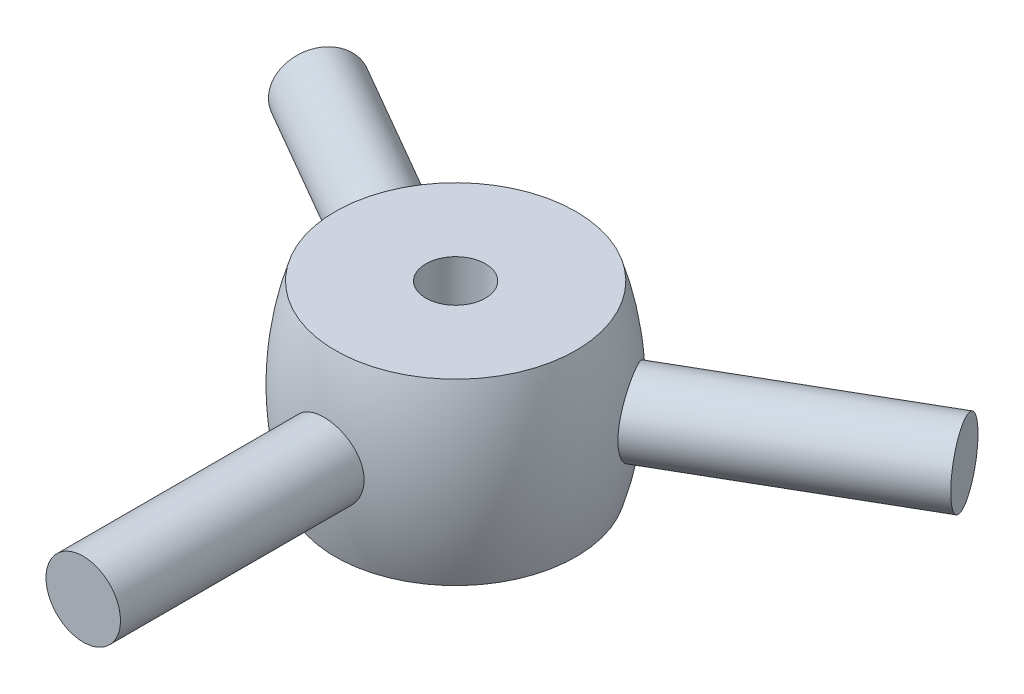
ISO-10303-21;
HEADER;
FILE_DESCRIPTION(('STEP AP214'),'2;1');
FILE_NAME('part.step','',(''),(''),'','','');
FILE_SCHEMA(('AUTOMOTIVE_DESIGN { 1 0 10303 214 1 1 1 1 }'));
ENDSEC;
DATA;
#1=APPLICATION_CONTEXT('core data for automotive mechanical design processes');
#2=APPLICATION_PROTOCOL_DEFINITION('international standard','automotive_design',2000,#1);
#3=PRODUCT_CONTEXT('',#1,'mechanical');
#4=PRODUCT('Part','Part','',(#3));
#5=PRODUCT_RELATED_PRODUCT_CATEGORY('part','',(#4));
#6=PRODUCT_DEFINITION_FORMATION('','',#4);
#7=PRODUCT_DEFINITION_CONTEXT('part definition',#1,'design');
#8=PRODUCT_DEFINITION('design','',#6,#7);
#9=PRODUCT_DEFINITION_SHAPE('','',#8);
#10=(LENGTH_UNIT() NAMED_UNIT(*) SI_UNIT(.MILLI.,.METRE.));
#11=(NAMED_UNIT(*) PLANE_ANGLE_UNIT() SI_UNIT($,.RADIAN.));
#12=(NAMED_UNIT(*) SI_UNIT($,.STERADIAN.) SOLID_ANGLE_UNIT());
#13=UNCERTAINTY_MEASURE_WITH_UNIT(LENGTH_MEASURE(1.E-05),#10,'distance_accuracy_value','');
#14=(GEOMETRIC_REPRESENTATION_CONTEXT(3) GLOBAL_UNCERTAINTY_ASSIGNED_CONTEXT((#13)) GLOBAL_UNIT_ASSIGNED_CONTEXT((#10,
#11,#12)) REPRESENTATION_CONTEXT('',''));
#15=CARTESIAN_POINT('',(0.,0.,0.));
#16=DIRECTION('',(0.,0.,1.));
#17=DIRECTION('',(1.,0.,0.));
#18=AXIS2_PLACEMENT_3D('',#15,#16,#17);
#19=CARTESIAN_POINT('',(0.,0.,0.));
#20=DIRECTION('',(0.,-1.,0.));
#21=DIRECTION('',(0.,0.,-1.));
#22=AXIS2_PLACEMENT_3D('',#19,#20,#21);
#23=DEGENERATE_TOROIDAL_SURFACE('',#22,5.5,10.,.F.);
#24=CARTESIAN_POINT('',(-3.24845380329226,-0.689243322092074,-3.07962393393491));
#25=CARTESIAN_POINT('',(-3.22484438254061,-0.631097070289249,-3.11036677556222));
#26=CARTESIAN_POINT('',(-3.20396061353493,-0.569677224789108,-3.13709665875448));
#27=CARTESIAN_POINT('',(-3.16860573594217,-0.44198786587889,-3.18193798904436));
#28=CARTESIAN_POINT('',(-3.15413993316492,-0.375714392448993,-3.20004230619273));
#29=CARTESIAN_POINT('',(-3.13232272188576,-0.240196785786498,-3.22722233877392));
#30=CARTESIAN_POINT('',(-3.12497188888781,-0.170952412721672,-3.23629732385868));
#31=CARTESIAN_POINT('',(-3.11775209346771,-0.0315001414362864,-3.24521127344618));
#32=CARTESIAN_POINT('',(-3.11788154369118,0.0387075492019343,-3.24505219746389));
#33=CARTESIAN_POINT('',(-3.12558497221378,0.177609367819586,-3.235539586718));
#34=CARTESIAN_POINT('',(-3.13310934250027,0.246310463708132,-3.2262473209237));
#35=CARTESIAN_POINT('',(-3.15516435448313,0.380743401034796,-3.19876074505131));
#36=CARTESIAN_POINT('',(-3.16969538129634,0.446475079043348,-3.18056594564978));
#37=CARTESIAN_POINT('',(-3.20514291509536,0.573358149666035,-3.13558653178809));
#38=CARTESIAN_POINT('',(-3.22608038494492,0.634493672434797,-3.10877370306494));
#39=CARTESIAN_POINT('',(-3.27338884726856,0.750281810713347,-3.04713771342991));
#40=CARTESIAN_POINT('',(-3.2997602223925,0.804933969244193,-3.01231398837907));
#41=CARTESIAN_POINT('',(-3.35714196603362,0.906843637498807,-2.93495712807962));
#42=CARTESIAN_POINT('',(-3.38820061044745,0.954012264357967,-2.89234265375952));
#43=CARTESIAN_POINT('',(-3.45347180379742,1.0388992989763,-2.80060954030891));
#44=CARTESIAN_POINT('',(-3.48768438732015,1.07661760308486,-2.75149082984934));
#45=CARTESIAN_POINT('',(-3.5580069527427,1.14157906135127,-2.64780810781039));
#46=CARTESIAN_POINT('',(-3.59412005554269,1.1688043332913,-2.59323499836818));
#47=CARTESIAN_POINT('',(-3.66687265254488,1.21187272092588,-2.48009480451684));
#48=CARTESIAN_POINT('',(-3.70351210921709,1.22771664406285,-2.42152800376038));
#49=CARTESIAN_POINT('',(-3.77571054430428,1.24743527803801,-2.302597406924));
#50=CARTESIAN_POINT('',(-3.81127669721551,1.25142923625236,-2.24225772839122));
#51=CARTESIAN_POINT('',(-3.88064136698696,1.24766411242021,-2.12093491783673));
#52=CARTESIAN_POINT('',(-3.9144399546915,1.23990550179284,-2.05995181172164));
#53=CARTESIAN_POINT('',(-3.97918824846147,1.21295855889574,-1.93951412803015));
#54=CARTESIAN_POINT('',(-4.01015419170858,1.1938407887394,-1.88005245816648));
#55=CARTESIAN_POINT('',(-4.06881572242904,1.14480038563866,-1.76404404847545));
#56=CARTESIAN_POINT('',(-4.09651115928154,1.11487725531836,-1.70749744296684));
#57=CARTESIAN_POINT('',(-4.14836437924273,1.04483010672676,-1.59864819992667));
#58=CARTESIAN_POINT('',(-4.17249541187546,1.00463458151197,-1.54637884945278));
#59=CARTESIAN_POINT('',(-4.21670096481432,0.915271210789765,-1.4481760552166));
#60=CARTESIAN_POINT('',(-4.23677521461299,0.866102767381299,-1.40224303402735));
#61=CARTESIAN_POINT('',(-4.27289423714879,0.759622658544626,-1.31779243360148));
#62=CARTESIAN_POINT('',(-4.2888983499025,0.702237142587121,-1.27935051441136));
#63=CARTESIAN_POINT('',(-4.31656299025421,0.581277268829629,-1.21176084753875));
#64=CARTESIAN_POINT('',(-4.32822360650662,0.517703037379932,-1.18261291016003));
#65=CARTESIAN_POINT('',(-4.34716566529554,0.386336396174407,-1.13472857359162));
#66=CARTESIAN_POINT('',(-4.35445926838257,0.318556285437204,-1.11596327369829));
#67=CARTESIAN_POINT('',(-4.36472523142693,0.180561892828413,-1.08942546313328));
#68=CARTESIAN_POINT('',(-4.36769793556495,0.110347805291171,-1.08165207690336));
#69=CARTESIAN_POINT('',(-4.36932008286944,-0.0296850615935567,-1.07741914020982));
#70=CARTESIAN_POINT('',(-4.36801728306748,-0.0994995407915165,-1.08083461036708));
#71=CARTESIAN_POINT('',(-4.36119050959416,-0.237515472930417,-1.09857474901346));
#72=CARTESIAN_POINT('',(-4.35566657506817,-0.305716940823833,-1.11289931633531));
#73=CARTESIAN_POINT('',(-4.34040452444434,-0.438450365676257,-1.15188537578522));
#74=CARTESIAN_POINT('',(-4.33067473622807,-0.502989290506272,-1.17652643752318));
#75=CARTESIAN_POINT('',(-4.30700176587148,-0.626773666431315,-1.23526575882348));
#76=CARTESIAN_POINT('',(-4.29305830687772,-0.686018769371539,-1.26936463978674));
#77=CARTESIAN_POINT('',(-4.26082396898249,-0.798190441094293,-1.34625695915239));
#78=CARTESIAN_POINT('',(-4.24248989579847,-0.851045838348998,-1.38913612749267));
#79=CARTESIAN_POINT('',(-4.20165501179393,-0.948275340661744,-1.48194973514138));
#80=CARTESIAN_POINT('',(-4.17915400819929,-0.992649053139696,-1.53188450083661));
#81=CARTESIAN_POINT('',(-4.13004401388521,-1.07193804956651,-1.63755922359385));
#82=CARTESIAN_POINT('',(-4.10340918881673,-1.10678976032526,-1.69333491694396));
#83=CARTESIAN_POINT('',(-4.04653346846624,-1.16563132085526,-1.80865120686594));
#84=CARTESIAN_POINT('',(-4.01629275347636,-1.18962171339787,-1.86819161513466));
#85=CARTESIAN_POINT('',(-3.95303438635995,-1.22588659846702,-1.98875116518105));
#86=CARTESIAN_POINT('',(-3.92003811505983,-1.23824356144826,-2.04975670486424));
#87=CARTESIAN_POINT('',(-3.85189622283417,-1.25115567359173,-2.17181201984632));
#88=CARTESIAN_POINT('',(-3.8167508026085,-1.25171192308953,-2.23286179049013));
#89=CARTESIAN_POINT('',(-3.74566734557912,-1.24106049724961,-2.35265322518054));
#90=CARTESIAN_POINT('',(-3.70974017092101,-1.22996581663033,-2.41141143155223));
#91=CARTESIAN_POINT('',(-3.63790139436128,-1.19651921347012,-2.52565705595127));
#92=CARTESIAN_POINT('',(-3.60198979709181,-1.17416500976333,-2.58114380864039));
#93=CARTESIAN_POINT('',(-3.53131763704644,-1.11877507294659,-2.68759243887384));
#94=CARTESIAN_POINT('',(-3.49656095155657,-1.08570671866239,-2.73853988383647));
#95=CARTESIAN_POINT('',(-3.42961171363547,-1.00986379471403,-2.83448988734019));
#96=CARTESIAN_POINT('',(-3.39741706842253,-0.967097259188263,-2.87949731814036));
#97=CARTESIAN_POINT('',(-3.34502986026555,-0.885788988805144,-2.95135209256183));
#98=CARTESIAN_POINT('',(-3.32394519003071,-0.849229369299132,-2.97981994499963));
#99=CARTESIAN_POINT('',(-3.28424417373358,-0.772105039698048,-3.03277435234734));
#100=CARTESIAN_POINT('',(-3.26562785567472,-0.731540284173868,-3.05726086208968));
#101=CARTESIAN_POINT('',(-3.24845380329226,-0.689243322092074,-3.07962393393491));
#102=B_SPLINE_CURVE_WITH_KNOTS('',3,(#24,#25,#26,#27,#28,#29,#30,#31,#32,#33,#34,#35,#36,#37,
#38,#39,#40,#41,#42,#43,#44,#45,#46,#47,#48,#49,#50,#51,#52,#53,#54,#55,#56,#57,#58,#59,#60,#61,
#62,#63,#64,#65,#66,#67,#68,#69,#70,#71,#72,#73,#74,#75,#76,#77,#78,#79,#80,#81,#82,#83,#84,#85,
#86,#87,#88,#89,#90,#91,#92,#93,#94,#95,#96,#97,#98,#99,#100,#101),.UNSPECIFIED.,.T.,.F.,(4,2,2,
2,2,2,2,2,2,2,2,2,2,2,2,2,2,2,2,2,2,2,2,2,2,2,2,2,2,2,2,2,2,2,2,2,2,2,4),(0.,0.209465061458476,
0.419102968986675,0.628757831943502,0.838368205228804,1.04658196218851,1.25480716480222,
1.46372113355804,1.672649818845,1.88389927677195,2.09515105156978,2.30676126617535,
2.51835646674836,2.7278150176948,2.93726516706088,3.14542763643549,3.35359968884958,
3.56326230882089,3.77293890454672,3.98463442454076,4.1963256234147,4.40742456374572,
4.61850668809395,4.82723910215611,5.03596958052795,5.244288637819,5.45262138540469,
5.66309457920607,5.87357751253319,6.08543316978479,6.29727823883024,6.50760995270981,
6.7179220545138,6.92621315057687,7.13454646315049,7.34352014072607,7.55232132930368,
7.70468945250051,7.85705930416375),.UNSPECIFIED.);
#103=CARTESIAN_POINT('',(-3.24845380329226,-0.689243322092074,-3.07962393393491));
#104=VERTEX_POINT('',#103);
#105=EDGE_CURVE('E54',#104,#104,#102,.T.);
#106=ORIENTED_EDGE('',*,*,#105,.T.);
#107=EDGE_LOOP('',(#106));
#108=FACE_BOUND('',#107,.T.);
#109=CARTESIAN_POINT('',(0.,-3.,0.));
#110=DIRECTION('',(0.,-1.,0.));
#111=DIRECTION('',(0.,0.,-1.));
#112=AXIS2_PLACEMENT_3D('',#109,#110,#111);
#113=CIRCLE('',#112,4.03939201416946);
#114=CARTESIAN_POINT('',(0.,-3.,-4.03939201416946));
#115=VERTEX_POINT('',#114);
#116=EDGE_CURVE('E10',#115,#115,#113,.T.);
#117=ORIENTED_EDGE('',*,*,#116,.F.);
#118=EDGE_LOOP('',(#117));
#119=FACE_BOUND('',#118,.T.);
#120=CARTESIAN_POINT('',(0.,3.,0.));
#121=DIRECTION('',(0.,-1.,0.));
#122=DIRECTION('',(0.,0.,-1.));
#123=AXIS2_PLACEMENT_3D('',#120,#121,#122);
#124=CIRCLE('',#123,4.03939201416946);
#125=CARTESIAN_POINT('',(0.,3.,-4.03939201416946));
#126=VERTEX_POINT('',#125);
#127=EDGE_CURVE('E40',#126,#126,#124,.T.);
#128=ORIENTED_EDGE('',*,*,#127,.T.);
#129=EDGE_LOOP('',(#128));
#130=FACE_BOUND('',#129,.T.);
#131=CARTESIAN_POINT('',(-0.902349270970049,-0.865023579552035,4.37033396263278));
#132=CARTESIAN_POINT('',(-0.950826236301777,-0.814451167408649,4.36480830377411));
#133=CARTESIAN_POINT('',(-0.995072060043534,-0.759765329636061,4.35931206363191));
#134=CARTESIAN_POINT('',(-1.07383081505605,-0.64367362680134,4.34899657767091));
#135=CARTESIAN_POINT('',(-1.10833483290967,-0.582261678411873,4.34417795385767));
#136=CARTESIAN_POINT('',(-1.16658348402315,-0.454438206322428,4.33577067800078));
#137=CARTESIAN_POINT('',(-1.19032737546748,-0.388026338290173,4.33218211076281));
#138=CARTESIAN_POINT('',(-1.22632887911072,-0.252108450274708,4.3266534145218));
#139=CARTESIAN_POINT('',(-1.23858943322889,-0.182603227561335,4.324712863325));
#140=CARTESIAN_POINT('',(-1.25120503586591,-0.0430598484085646,4.32271500930394));
#141=CARTESIAN_POINT('',(-1.25165532073399,0.0269694867570233,4.32264264178421));
#142=CARTESIAN_POINT('',(-1.24087828862005,0.166100982868291,4.32435119466003));
#143=CARTESIAN_POINT('',(-1.22965086177726,0.235203135085089,4.32613213249098));
#144=CARTESIAN_POINT('',(-1.19593755530887,0.370206579772707,4.33132896629747));
#145=CARTESIAN_POINT('',(-1.17350217641447,0.436120788244821,4.33473752553052));
#146=CARTESIAN_POINT('',(-1.11805674985026,0.563257862485754,4.34280014704268));
#147=CARTESIAN_POINT('',(-1.08504610982513,0.624480465224127,4.34745427908803));
#148=CARTESIAN_POINT('',(-1.00903933271762,0.74109873354868,4.35753518601013));
#149=CARTESIAN_POINT('',(-0.965955966001094,0.796436972566622,4.36296854018324));
#150=CARTESIAN_POINT('',(-0.871164718149322,0.899141864268421,4.3739699808113));
#151=CARTESIAN_POINT('',(-0.819456356150081,0.946508072196619,4.37953807476351));
#152=CARTESIAN_POINT('',(-0.708357730922097,1.03232604216622,4.39023832683141));
#153=CARTESIAN_POINT('',(-0.648906441080784,1.07069937087848,4.39536641875863));
#154=CARTESIAN_POINT('',(-0.524323507268607,1.13690826824931,4.40455727148864));
#155=CARTESIAN_POINT('',(-0.459192064557493,1.16474421008315,4.40862007001658));
#156=CARTESIAN_POINT('',(-0.325435787804211,1.20893632109342,4.41520494162052));
#157=CARTESIAN_POINT('',(-0.256830352055477,1.22535001116708,4.41773472628984));
#158=CARTESIAN_POINT('',(-0.117797183576721,1.24642146080506,4.42100048960749));
#159=CARTESIAN_POINT('',(-0.0473695825907794,1.25108006788555,4.42173659757592));
#160=CARTESIAN_POINT('',(0.0925229026946356,1.24851224050449,4.42133434769066));
#161=CARTESIAN_POINT('',(0.161990151779131,1.2414096054454,4.42021551488175));
#162=CARTESIAN_POINT('',(0.298729532376155,1.21577117191607,4.41626467754395));
#163=CARTESIAN_POINT('',(0.36600165834693,1.19723534458422,4.41343266869038));
#164=CARTESIAN_POINT('',(0.496483824442897,1.14927670365884,4.40636660766489));
#165=CARTESIAN_POINT('',(0.559692786231047,1.11985101385402,4.40213218512102));
#166=CARTESIAN_POINT('',(0.680302249521757,1.05095812363704,4.39272458868316));
#167=CARTESIAN_POINT('',(0.737702348532946,1.01149022807356,4.38755134980863));
#168=CARTESIAN_POINT('',(0.845713958596434,0.923139796517719,4.37677260358947));
#169=CARTESIAN_POINT('',(0.89624727619192,0.874162130450864,4.37116310413546));
#170=CARTESIAN_POINT('',(0.988409540707732,0.768417755743659,4.36018550923008));
#171=CARTESIAN_POINT('',(1.03003817365584,0.711650772573883,4.35481742229601));
#172=CARTESIAN_POINT('',(1.10339612299871,0.591598324587757,4.34490359328096));
#173=CARTESIAN_POINT('',(1.13507707979856,0.528282946406529,4.34036191227244));
#174=CARTESIAN_POINT('',(1.18733184077198,0.397144957731506,4.33265841777449));
#175=CARTESIAN_POINT('',(1.20790636168426,0.329322638404337,4.32949651524547));
#176=CARTESIAN_POINT('',(1.23719384415121,0.191719929384071,4.32494408314591));
#177=CARTESIAN_POINT('',(1.24600794959921,0.121961573640894,4.32353845571888));
#178=CARTESIAN_POINT('',(1.25183186687052,-0.0180565625918049,4.32261317330679));
#179=CARTESIAN_POINT('',(1.2488423533173,-0.0883163141954722,4.3230934105371));
#180=CARTESIAN_POINT('',(1.23123114249638,-0.226700850981646,4.32587085761782));
#181=CARTESIAN_POINT('',(1.21671065927656,-0.294838875814878,4.32815225661175));
#182=CARTESIAN_POINT('',(1.17660000715886,-0.427701125818237,4.3342509312322));
#183=CARTESIAN_POINT('',(1.15100946843147,-0.492425236854942,4.33806825817086));
#184=CARTESIAN_POINT('',(1.08934762029105,-0.616989129523063,4.34683022076189));
#185=CARTESIAN_POINT('',(1.05322483205833,-0.676803025672468,4.35178036713731));
#186=CARTESIAN_POINT('',(0.971564645936329,-0.789562402829591,4.36224389114983));
#187=CARTESIAN_POINT('',(0.92602656444599,-0.842507384662577,4.36775730966882));
#188=CARTESIAN_POINT('',(0.826241208863053,-0.94062418880073,4.37879891850056));
#189=CARTESIAN_POINT('',(0.771905005877525,-0.985705676312411,4.38432662281377));
#190=CARTESIAN_POINT('',(0.656384282761489,-1.06612026853788,4.39471770140513));
#191=CARTESIAN_POINT('',(0.595199755653541,-1.10145336331936,4.39958107500639));
#192=CARTESIAN_POINT('',(0.467688846619734,-1.16134751594683,4.40809839179386));
#193=CARTESIAN_POINT('',(0.401362693764623,-1.18590905336522,4.41175238882228));
#194=CARTESIAN_POINT('',(0.26545930709381,-1.22352001165715,4.41743848932204));
#195=CARTESIAN_POINT('',(0.195882411163025,-1.23657062619489,4.41947076096162));
#196=CARTESIAN_POINT('',(0.0562464109373863,-1.25068320353868,4.42167147853272));
#197=CARTESIAN_POINT('',(-0.0137996220700975,-1.25187162845719,4.42185958462045));
#198=CARTESIAN_POINT('',(-0.153101980633675,-1.24255092093109,4.42040211436368));
#199=CARTESIAN_POINT('',(-0.222358181004389,-1.23203995951088,4.41875625131309));
#200=CARTESIAN_POINT('',(-0.357793192760782,-1.19971341091355,4.41382511369009));
#201=CARTESIAN_POINT('',(-0.423983981582906,-1.17794674376388,4.41054693582175));
#202=CARTESIAN_POINT('',(-0.551734043327892,-1.12378615674388,4.4027157342008));
#203=CARTESIAN_POINT('',(-0.613297200338905,-1.09140127425466,4.3981637950537));
#204=CARTESIAN_POINT('',(-0.71376149291573,-1.0273926530857,4.38966952182413));
#205=CARTESIAN_POINT('',(-0.754181688141285,-0.998094408327208,4.38591333009987));
#206=CARTESIAN_POINT('',(-0.831231564818749,-0.934899336448398,4.37821111855704));
#207=CARTESIAN_POINT('',(-0.867861184713835,-0.901002434669115,4.37426509565723));
#208=CARTESIAN_POINT('',(-0.902349270970049,-0.865023579552035,4.37033396263278));
#209=B_SPLINE_CURVE_WITH_KNOTS('',3,(#131,#132,#133,#134,#135,#136,#137,#138,#139,#140,#141,
#142,#143,#144,#145,#146,#147,#148,#149,#150,#151,#152,#153,#154,#155,#156,#157,#158,#159,#160,
#161,#162,#163,#164,#165,#166,#167,#168,#169,#170,#171,#172,#173,#174,#175,#176,#177,#178,#179,
#180,#181,#182,#183,#184,#185,#186,#187,#188,#189,#190,#191,#192,#193,#194,#195,#196,#197,#198,
#199,#200,#201,#202,#203,#204,#205,#206,#207,#208),.UNSPECIFIED.,.T.,.F.,(4,2,2,2,2,2,2,2,2,2,2,
2,2,2,2,2,2,2,2,2,2,2,2,2,2,2,2,2,2,2,2,2,2,2,2,2,2,2,4),(0.,0.210636023020492,
0.421464150773099,0.63230681104972,0.843095440702335,1.05218377334291,1.26127407304793,
1.4694306390131,1.67759886655467,1.88764136229788,2.09769557232618,2.30951877622365,
2.52133447782689,2.73207563123224,2.94280159022018,3.15132350631561,3.35984594879961,
3.56842350521508,3.7770155039187,3.987812973329,4.19861787406848,4.41043225878616,
4.62223297271649,4.83220012227658,5.04215527155796,5.25028762459176,5.45842693146858,
5.66760112826918,5.87679051758073,6.08824405873803,6.29969781533751,6.5111421566148,
6.72256456887504,6.93173058047266,7.14092929577449,7.34922633087487,7.55734653831476,
7.70719740729912,7.85705070939603),.UNSPECIFIED.);
#210=CARTESIAN_POINT('',(-0.902349270970049,-0.865023579552035,4.37033396263278));
#211=VERTEX_POINT('',#210);
#212=EDGE_CURVE('E45',#211,#211,#209,.T.);
#213=ORIENTED_EDGE('',*,*,#212,.T.);
#214=EDGE_LOOP('',(#213));
#215=FACE_BOUND('',#214,.T.);
#216=CARTESIAN_POINT('',(3.17101416261788,-0.446767004735341,-3.17882111409522));
#217=CARTESIAN_POINT('',(3.18682108134622,-0.512489414060638,-3.1589014070639));
#218=CARTESIAN_POINT('',(3.20602044374449,-0.576087373722627,-3.13451525391248));
#219=CARTESIAN_POINT('',(3.25031948510644,-0.697210313745669,-3.07732835160778));
#220=CARTESIAN_POINT('',(3.27542551729646,-0.754728657633112,-3.04451853845553));
#221=CARTESIAN_POINT('',(3.330408263502,-0.862019355979856,-2.97121691326504));
#222=CARTESIAN_POINT('',(3.36028196189511,-0.911796567788444,-2.93072995411464));
#223=CARTESIAN_POINT('',(3.42356579215489,-1.00225282944515,-2.84295443039485));
#224=CARTESIAN_POINT('',(3.45697515179057,-1.04293385999138,-2.79566735024743));
#225=CARTESIAN_POINT('',(3.52610667773606,-1.11414057919768,-2.69525401539263));
#226=CARTESIAN_POINT('',(3.56183388943356,-1.14464316119466,-2.64211483407302));
#227=CARTESIAN_POINT('',(3.63420521764856,-1.19446232757076,-2.53139908520168));
#228=CARTESIAN_POINT('',(3.6708493051075,-1.21377926598935,-2.47382265815963));
#229=CARTESIAN_POINT('',(3.74344791584257,-1.2405129748939,-2.35630845805225));
#230=CARTESIAN_POINT('',(3.77940568021415,-1.24803673439039,-2.29639702889311));
#231=CARTESIAN_POINT('',(3.84984994017987,-1.25128887615137,-2.1754029301152));
#232=CARTESIAN_POINT('',(3.88433651277841,-1.24701787654264,-2.11432032204089));
#233=CARTESIAN_POINT('',(3.95063310521753,-1.2268934970974,-1.99324828841047));
#234=CARTESIAN_POINT('',(3.98246187763685,-1.21113057606453,-1.93325405403543));
#235=CARTESIAN_POINT('',(4.04302237387957,-1.16859670365678,-1.81565374874466));
#236=CARTESIAN_POINT('',(4.07175399522964,-1.14182538819565,-1.75804775688587));
#237=CARTESIAN_POINT('',(4.12575486868184,-1.07787488175149,-1.64666428261277));
#238=CARTESIAN_POINT('',(4.151004492409,-1.04064001746238,-1.59290926457253));
#239=CARTESIAN_POINT('',(4.19752821523518,-0.956870065919717,-1.49124067037777));
#240=CARTESIAN_POINT('',(4.21880202814121,-0.910334309653485,-1.44332751482749));
#241=CARTESIAN_POINT('',(4.25739341311982,-0.808705447826399,-1.35440912156008));
#242=CARTESIAN_POINT('',(4.27466742954079,-0.753528189796983,-1.31348110574001));
#243=CARTESIAN_POINT('',(4.30489022666436,-0.636500666735079,-1.2405345102472));
#244=CARTESIAN_POINT('',(4.31783902616504,-0.574650430705961,-1.20851589185291));
#245=CARTESIAN_POINT('',(4.33938495789852,-0.446040748127036,-1.15453970481269));
#246=CARTESIAN_POINT('',(4.34798472780317,-0.379284305384116,-1.1325760386398));
#247=CARTESIAN_POINT('',(4.36084867141173,-0.242735415962359,-1.09950000840546));
#248=CARTESIAN_POINT('',(4.36511319039728,-0.172943211528926,-1.08838678016226));
#249=CARTESIAN_POINT('',(4.36929242776076,-0.0331248776235379,-1.07749653944982));
#250=CARTESIAN_POINT('',(4.3692543913575,0.0368902697812887,-1.07759639895095));
#251=CARTESIAN_POINT('',(4.36494626943877,0.17589705424232,-1.08882097406287));
#252=CARTESIAN_POINT('',(4.3606762864993,0.244888716065133,-1.09994542245423));
#253=CARTESIAN_POINT('',(4.34792350221499,0.379605459841415,-1.13273127676585));
#254=CARTESIAN_POINT('',(4.33945820508612,0.445342876576863,-1.15434889412876));
#255=CARTESIAN_POINT('',(4.31831831240006,0.572043500894861,-1.20732228857995));
#256=CARTESIAN_POINT('',(4.30564346467291,0.633006422194419,-1.23867864905301));
#257=CARTESIAN_POINT('',(4.27596649099621,0.749039442016161,-1.3103809864891));
#258=CARTESIAN_POINT('',(4.25892560166167,0.804050123445776,-1.35080706575366));
#259=CARTESIAN_POINT('',(4.22065137645452,0.9060291180411,-1.43913161574795));
#260=CARTESIAN_POINT('',(4.19941780826145,0.952996985277125,-1.48703050052234));
#261=CARTESIAN_POINT('',(4.15274519310529,1.03794291249948,-1.58918025178856));
#262=CARTESIAN_POINT('',(4.12727314152159,1.07584423092242,-1.64347990795607));
#263=CARTESIAN_POINT('',(4.07258601481721,1.14106228902564,-1.75638194746253));
#264=CARTESIAN_POINT('',(4.04337108234193,1.16837943192114,-1.81498416678965));
#265=CARTESIAN_POINT('',(3.98190036857375,1.21149728777755,-1.93433686558589));
#266=CARTESIAN_POINT('',(3.94966178119256,1.22735913010812,-1.99507410070329));
#267=CARTESIAN_POINT('',(3.88276155254614,1.24731788124139,-2.11714238489373));
#268=CARTESIAN_POINT('',(3.84810008554511,1.25141563527915,-2.17847339098737));
#269=CARTESIAN_POINT('',(3.77768273674879,1.24774025955573,-2.29928845014193));
#270=CARTESIAN_POINT('',(3.74194192255859,1.24008973258696,-2.35878505794757));
#271=CARTESIAN_POINT('',(3.67012936398074,1.2133780672869,-2.47494771639452));
#272=CARTESIAN_POINT('',(3.63405761754883,1.19431685842138,-2.53161374953651));
#273=CARTESIAN_POINT('',(3.56277753815302,1.14533614443369,-2.64068224195772));
#274=CARTESIAN_POINT('',(3.52756973782768,1.11541011202111,-2.69308211502737));
#275=CARTESIAN_POINT('',(3.45930630957929,1.04555934218585,-2.79232564279358));
#276=CARTESIAN_POINT('',(3.42625083402722,1.00563389783562,-2.83916890430967));
#277=CARTESIAN_POINT('',(3.36321875719706,0.916414281721959,-2.92671308989339));
#278=CARTESIAN_POINT('',(3.33327872276164,0.867024799319529,-2.96734323290055));
#279=CARTESIAN_POINT('',(3.27811900472877,0.760523218444155,-3.0409701302806));
#280=CARTESIAN_POINT('',(3.25289934144041,0.703411086746835,-3.07396685181132));
#281=CARTESIAN_POINT('',(3.20818286191662,0.582767259331349,-3.13175186988375));
#282=CARTESIAN_POINT('',(3.18871167346458,0.519208464030869,-3.15650346914844));
#283=CARTESIAN_POINT('',(3.15654984069574,0.387659220238601,-3.19706285287205));
#284=CARTESIAN_POINT('',(3.14386005812052,0.319668209757811,-3.21286950067367));
#285=CARTESIAN_POINT('',(3.12596200871544,0.181818932249786,-3.23509009365065));
#286=CARTESIAN_POINT('',(3.12069109030056,0.111981439076533,-3.24158270404994));
#287=CARTESIAN_POINT('',(3.11769712142512,-0.028052089768305,-3.24527652662501));
#288=CARTESIAN_POINT('',(3.11996642110118,-0.0982476899553739,-3.24248715575078));
#289=CARTESIAN_POINT('',(3.13004317413796,-0.215325002983025,-3.23002063009801));
#290=CARTESIAN_POINT('',(3.13590433648213,-0.26265493133518,-3.22276087115599));
#291=CARTESIAN_POINT('',(3.15098652362328,-0.355909891209429,-3.20397030190284));
#292=CARTESIAN_POINT('',(3.16020753394771,-0.401834928782162,-3.19243950998918));
#293=CARTESIAN_POINT('',(3.17101416261788,-0.446767004735341,-3.17882111409522));
#294=B_SPLINE_CURVE_WITH_KNOTS('',3,(#216,#217,#218,#219,#220,#221,#222,#223,#224,#225,#226,
#227,#228,#229,#230,#231,#232,#233,#234,#235,#236,#237,#238,#239,#240,#241,#242,#243,#244,#245,
#246,#247,#248,#249,#250,#251,#252,#253,#254,#255,#256,#257,#258,#259,#260,#261,#262,#263,#264,
#265,#266,#267,#268,#269,#270,#271,#272,#273,#274,#275,#276,#277,#278,#279,#280,#281,#282,#283,
#284,#285,#286,#287,#288,#289,#290,#291,#292,#293),.UNSPECIFIED.,.T.,.F.,(4,2,2,2,2,2,2,2,2,2,2,
2,2,2,2,2,2,2,2,2,2,2,2,2,2,2,2,2,2,2,2,2,2,2,2,2,2,2,4),(0.,0.211234873838802,
0.422697999547444,0.634027897838198,0.845311734024794,1.05707200510673,1.26882557334737,
1.47864673596669,1.68845690271761,1.89663313673334,2.10481625642198,2.31412873821547,
2.52345628126681,2.73496605394597,2.94647490735804,3.15785532705313,3.36921891000787,
3.57826179331409,3.78729960985986,3.99547250378165,4.20365787039387,4.41375982508195,
4.62387342499543,4.83570709356425,5.04753269131491,5.25821939111047,5.46889095295067,
5.6773788805153,5.88586809684478,6.0944827756542,6.30311220704247,6.51396506374755,
6.72481882761254,6.93659889390848,7.14840586558656,7.35841319109993,7.56820752056936,
7.7126219200996,7.85703569757248),.UNSPECIFIED.);
#295=CARTESIAN_POINT('',(3.17101416261788,-0.446767004735341,-3.17882111409522));
#296=VERTEX_POINT('',#295);
#297=EDGE_CURVE('E33',#296,#296,#294,.T.);
#298=ORIENTED_EDGE('',*,*,#297,.T.);
#299=EDGE_LOOP('',(#298));
#300=FACE_BOUND('',#299,.T.);
#301=ADVANCED_FACE('F29',(#108,#119,#130,#215,#300),#23,.F.);
#302=CARTESIAN_POINT('',(0.,-3.,0.));
#303=DIRECTION('',(0.,-1.,0.));
#304=DIRECTION('',(0.,0.,-1.));
#305=AXIS2_PLACEMENT_3D('',#302,#303,#304);
#306=PLANE('',#305);
#307=CARTESIAN_POINT('',(0.,-3.,0.));
#308=DIRECTION('',(0.,-1.,0.));
#309=DIRECTION('',(0.,0.,-1.));
#310=AXIS2_PLACEMENT_3D('',#307,#308,#309);
#311=CIRCLE('',#310,1.);
#312=CARTESIAN_POINT('',(0.,-3.,-1.));
#313=VERTEX_POINT('',#312);
#314=EDGE_CURVE('E102',#313,#313,#311,.T.);
#315=ORIENTED_EDGE('',*,*,#314,.F.);
#316=EDGE_LOOP('',(#315));
#317=FACE_BOUND('',#316,.T.);
#318=ORIENTED_EDGE('',*,*,#116,.T.);
#319=EDGE_LOOP('',(#318));
#320=FACE_BOUND('',#319,.T.);
#321=ADVANCED_FACE('F31',(#317,#320),#306,.T.);
#322=CARTESIAN_POINT('',(0.,3.,0.));
#323=DIRECTION('',(0.,1.,0.));
#324=DIRECTION('',(0.,0.,1.));
#325=AXIS2_PLACEMENT_3D('',#322,#323,#324);
#326=PLANE('',#325);
#327=CARTESIAN_POINT('',(0.,3.,0.));
#328=DIRECTION('',(0.,-1.,0.));
#329=DIRECTION('',(0.,0.,-1.));
#330=AXIS2_PLACEMENT_3D('',#327,#328,#329);
#331=CIRCLE('',#330,1.);
#332=CARTESIAN_POINT('',(0.,3.,-1.));
#333=VERTEX_POINT('',#332);
#334=EDGE_CURVE('E98',#333,#333,#331,.T.);
#335=ORIENTED_EDGE('',*,*,#334,.T.);
#336=EDGE_LOOP('',(#335));
#337=FACE_BOUND('',#336,.T.);
#338=ORIENTED_EDGE('',*,*,#127,.F.);
#339=EDGE_LOOP('',(#338));
#340=FACE_BOUND('',#339,.T.);
#341=ADVANCED_FACE('F65',(#337,#340),#326,.T.);
#342=CARTESIAN_POINT('',(0.,0.,12.5));
#343=DIRECTION('',(0.,0.,-1.));
#344=DIRECTION('',(-1.,0.,0.));
#345=AXIS2_PLACEMENT_3D('',#342,#343,#344);
#346=CYLINDRICAL_SURFACE('',#345,1.25);
#347=ORIENTED_EDGE('',*,*,#212,.F.);
#348=EDGE_LOOP('',(#347));
#349=FACE_BOUND('',#348,.T.);
#350=CARTESIAN_POINT('',(0.,0.,12.5));
#351=DIRECTION('',(0.,0.,1.));
#352=DIRECTION('',(1.,0.,0.));
#353=AXIS2_PLACEMENT_3D('',#350,#351,#352);
#354=CIRCLE('',#353,1.25);
#355=CARTESIAN_POINT('',(1.25,0.,12.5));
#356=VERTEX_POINT('',#355);
#357=EDGE_CURVE('E53',#356,#356,#354,.T.);
#358=ORIENTED_EDGE('',*,*,#357,.F.);
#359=EDGE_LOOP('',(#358));
#360=FACE_BOUND('',#359,.T.);
#361=ADVANCED_FACE('F60',(#349,#360),#346,.T.);
#362=CARTESIAN_POINT('',(0.,0.,12.5));
#363=DIRECTION('',(0.,0.,1.));
#364=DIRECTION('',(1.,0.,0.));
#365=AXIS2_PLACEMENT_3D('',#362,#363,#364);
#366=PLANE('',#365);
#367=ORIENTED_EDGE('',*,*,#357,.T.);
#368=EDGE_LOOP('',(#367));
#369=FACE_BOUND('',#368,.T.);
#370=ADVANCED_FACE('F64',(#369),#366,.T.);
#371=CARTESIAN_POINT('',(-10.8253175473055,0.,-6.2499999999999));
#372=DIRECTION('',(-0.866025403784443,0.,-0.499999999999992));
#373=DIRECTION('',(-0.499999999999992,0.,0.866025403784443));
#374=AXIS2_PLACEMENT_3D('',#371,#372,#373);
#375=PLANE('',#374);
#376=CARTESIAN_POINT('',(-10.8253175473055,0.,-6.2499999999999));
#377=DIRECTION('',(-0.866025403784443,0.,-0.499999999999992));
#378=DIRECTION('',(-0.499999999999992,0.,0.866025403784443));
#379=AXIS2_PLACEMENT_3D('',#376,#377,#378);
#380=CIRCLE('',#379,1.25);
#381=CARTESIAN_POINT('',(-11.4503175473055,0.,-5.16746824526935));
#382=VERTEX_POINT('',#381);
#383=EDGE_CURVE('E93',#382,#382,#380,.T.);
#384=ORIENTED_EDGE('',*,*,#383,.T.);
#385=EDGE_LOOP('',(#384));
#386=FACE_BOUND('',#385,.T.);
#387=ADVANCED_FACE('F118',(#386),#375,.T.);
#388=CARTESIAN_POINT('',(-10.8253175473055,0.,-6.2499999999999));
#389=DIRECTION('',(0.866025403784443,0.,0.499999999999992));
#390=DIRECTION('',(0.499999999999992,0.,-0.866025403784443));
#391=AXIS2_PLACEMENT_3D('',#388,#389,#390);
#392=CYLINDRICAL_SURFACE('',#391,1.25);
#393=ORIENTED_EDGE('',*,*,#105,.F.);
#394=EDGE_LOOP('',(#393));
#395=FACE_BOUND('',#394,.T.);
#396=ORIENTED_EDGE('',*,*,#383,.F.);
#397=EDGE_LOOP('',(#396));
#398=FACE_BOUND('',#397,.T.);
#399=ADVANCED_FACE('F120',(#395,#398),#392,.T.);
#400=CARTESIAN_POINT('',(10.8253175473055,0.,-6.25000000000005));
#401=DIRECTION('',(-0.866025403784436,0.,0.500000000000004));
#402=DIRECTION('',(0.500000000000004,0.,0.866025403784436));
#403=AXIS2_PLACEMENT_3D('',#400,#401,#402);
#404=CYLINDRICAL_SURFACE('',#403,1.25);
#405=ORIENTED_EDGE('',*,*,#297,.F.);
#406=EDGE_LOOP('',(#405));
#407=FACE_BOUND('',#406,.T.);
#408=CARTESIAN_POINT('',(10.8253175473055,0.,-6.25000000000005));
#409=DIRECTION('',(0.866025403784436,0.,-0.500000000000004));
#410=DIRECTION('',(-0.500000000000004,0.,-0.866025403784436));
#411=AXIS2_PLACEMENT_3D('',#408,#409,#410);
#412=CIRCLE('',#411,1.25);
#413=CARTESIAN_POINT('',(10.2003175473054,0.,-7.3325317547306));
#414=VERTEX_POINT('',#413);
#415=EDGE_CURVE('E91',#414,#414,#412,.T.);
#416=ORIENTED_EDGE('',*,*,#415,.F.);
#417=EDGE_LOOP('',(#416));
#418=FACE_BOUND('',#417,.T.);
#419=ADVANCED_FACE('F114',(#407,#418),#404,.T.);
#420=CARTESIAN_POINT('',(10.8253175473055,0.,-6.25000000000005));
#421=DIRECTION('',(0.866025403784436,0.,-0.500000000000004));
#422=DIRECTION('',(-0.500000000000004,0.,-0.866025403784436));
#423=AXIS2_PLACEMENT_3D('',#420,#421,#422);
#424=PLANE('',#423);
#425=ORIENTED_EDGE('',*,*,#415,.T.);
#426=EDGE_LOOP('',(#425));
#427=FACE_BOUND('',#426,.T.);
#428=ADVANCED_FACE('F108',(#427),#424,.T.);
#429=CARTESIAN_POINT('',(0.,3.,0.));
#430=DIRECTION('',(0.,-1.,0.));
#431=DIRECTION('',(0.,0.,-1.));
#432=AXIS2_PLACEMENT_3D('',#429,#430,#431);
#433=CYLINDRICAL_SURFACE('',#432,1.);
#434=ORIENTED_EDGE('',*,*,#334,.F.);
#435=EDGE_LOOP('',(#434));
#436=FACE_BOUND('',#435,.T.);
#437=ORIENTED_EDGE('',*,*,#314,.T.);
#438=EDGE_LOOP('',(#437));
#439=FACE_BOUND('',#438,.T.);
#440=ADVANCED_FACE('F106',(#436,#439),#433,.F.);
#441=CLOSED_SHELL('',(#301,#321,#341,#361,#370,#387,#399,#419,#428,#440));
#442=MANIFOLD_SOLID_BREP('B2',#441);
#443=ADVANCED_BREP_SHAPE_REPRESENTATION('',(#18,#442),#14);
#444=SHAPE_DEFINITION_REPRESENTATION(#9,#443);
ENDSEC;
END-ISO-10303-21;
